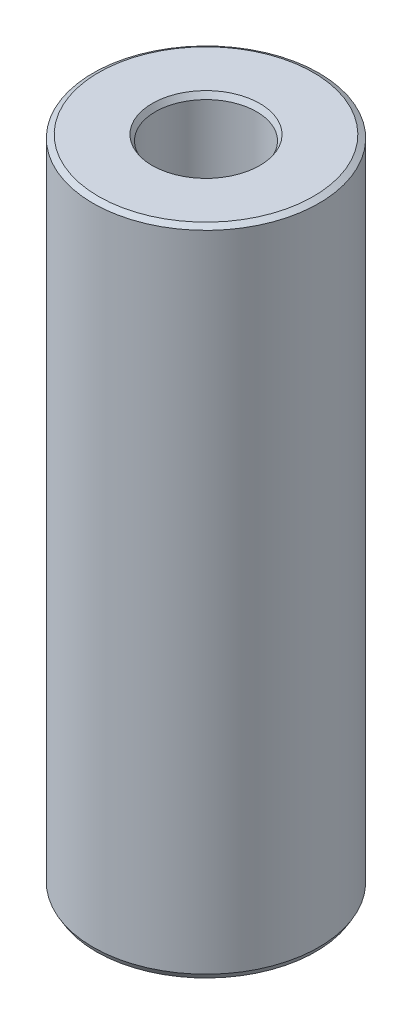
ISO-10303-21;
HEADER;
FILE_DESCRIPTION(('STEP AP214'),'2;1');
FILE_NAME('part.step','',(''),(''),'','','');
FILE_SCHEMA(('AUTOMOTIVE_DESIGN { 1 0 10303 214 1 1 1 1 }'));
ENDSEC;
DATA;
#1=APPLICATION_CONTEXT('core data for automotive mechanical design processes');
#2=APPLICATION_PROTOCOL_DEFINITION('international standard','automotive_design',2000,#1);
#3=PRODUCT_CONTEXT('',#1,'mechanical');
#4=PRODUCT('Part','Part','',(#3));
#5=PRODUCT_RELATED_PRODUCT_CATEGORY('part','',(#4));
#6=PRODUCT_DEFINITION_FORMATION('','',#4);
#7=PRODUCT_DEFINITION_CONTEXT('part definition',#1,'design');
#8=PRODUCT_DEFINITION('design','',#6,#7);
#9=PRODUCT_DEFINITION_SHAPE('','',#8);
#10=(LENGTH_UNIT() NAMED_UNIT(*) SI_UNIT(.MILLI.,.METRE.));
#11=(NAMED_UNIT(*) PLANE_ANGLE_UNIT() SI_UNIT($,.RADIAN.));
#12=(NAMED_UNIT(*) SI_UNIT($,.STERADIAN.) SOLID_ANGLE_UNIT());
#13=UNCERTAINTY_MEASURE_WITH_UNIT(LENGTH_MEASURE(1.E-05),#10,'distance_accuracy_value','');
#14=(GEOMETRIC_REPRESENTATION_CONTEXT(3) GLOBAL_UNCERTAINTY_ASSIGNED_CONTEXT((#13)) GLOBAL_UNIT_ASSIGNED_CONTEXT((#10,
#11,#12)) REPRESENTATION_CONTEXT('',''));
#15=CARTESIAN_POINT('',(0.,0.,0.));
#16=DIRECTION('',(0.,0.,1.));
#17=DIRECTION('',(1.,0.,0.));
#18=AXIS2_PLACEMENT_3D('',#15,#16,#17);
#19=CARTESIAN_POINT('',(0.,231.27756580033,0.));
#20=DIRECTION('',(0.,-1.,0.));
#21=DIRECTION('',(0.,0.,-1.));
#22=AXIS2_PLACEMENT_3D('',#19,#20,#21);
#23=CYLINDRICAL_SURFACE('',#22,40.);
#24=CARTESIAN_POINT('',(0.,1.96135844372239,0.));
#25=DIRECTION('',(0.,1.,0.));
#26=DIRECTION('',(0.,0.,1.));
#27=AXIS2_PLACEMENT_3D('',#24,#25,#26);
#28=CIRCLE('',#27,40.);
#29=CARTESIAN_POINT('',(0.,1.96135844372239,40.));
#30=VERTEX_POINT('',#29);
#31=EDGE_CURVE('E10',#30,#30,#28,.T.);
#32=ORIENTED_EDGE('',*,*,#31,.T.);
#33=EDGE_LOOP('',(#32));
#34=FACE_BOUND('',#33,.T.);
#35=CARTESIAN_POINT('',(0.,230.145174974869,0.));
#36=DIRECTION('',(0.,1.,0.));
#37=DIRECTION('',(0.,0.,1.));
#38=AXIS2_PLACEMENT_3D('',#35,#36,#37);
#39=CIRCLE('',#38,40.);
#40=CARTESIAN_POINT('',(0.,230.145174974869,40.));
#41=VERTEX_POINT('',#40);
#42=EDGE_CURVE('E50',#41,#41,#39,.F.);
#43=ORIENTED_EDGE('',*,*,#42,.T.);
#44=EDGE_LOOP('',(#43));
#45=FACE_BOUND('',#44,.T.);
#46=ADVANCED_FACE('F39',(#34,#45),#23,.T.);
#47=CARTESIAN_POINT('',(0.,231.27756580033,0.));
#48=DIRECTION('',(0.,1.,0.));
#49=DIRECTION('',(0.,0.,1.));
#50=AXIS2_PLACEMENT_3D('',#47,#48,#49);
#51=PLANE('',#50);
#52=CARTESIAN_POINT('',(0.,231.27756580033,0.));
#53=DIRECTION('',(0.,1.,0.));
#54=DIRECTION('',(0.,0.,1.));
#55=AXIS2_PLACEMENT_3D('',#52,#53,#54);
#56=CIRCLE('',#55,19.0580457046);
#57=CARTESIAN_POINT('',(0.,231.27756580033,19.0580457046));
#58=VERTEX_POINT('',#57);
#59=EDGE_CURVE('E58',#58,#58,#56,.F.);
#60=ORIENTED_EDGE('',*,*,#59,.T.);
#61=EDGE_LOOP('',(#60));
#62=FACE_BOUND('',#61,.T.);
#63=CARTESIAN_POINT('',(0.,231.27756580033,0.));
#64=DIRECTION('',(0.,1.,0.));
#65=DIRECTION('',(0.,0.,1.));
#66=AXIS2_PLACEMENT_3D('',#63,#64,#65);
#67=CIRCLE('',#66,38.0386415562776);
#68=CARTESIAN_POINT('',(0.,231.27756580033,38.0386415562776));
#69=VERTEX_POINT('',#68);
#70=EDGE_CURVE('E61',#69,#69,#67,.T.);
#71=ORIENTED_EDGE('',*,*,#70,.T.);
#72=EDGE_LOOP('',(#71));
#73=FACE_BOUND('',#72,.T.);
#74=ADVANCED_FACE('F88',(#62,#73),#51,.T.);
#75=CARTESIAN_POINT('',(0.,0.,0.));
#76=DIRECTION('',(0.,1.,0.));
#77=DIRECTION('',(0.,0.,1.));
#78=AXIS2_PLACEMENT_3D('',#75,#76,#77);
#79=PLANE('',#78);
#80=CARTESIAN_POINT('',(0.,0.,0.));
#81=DIRECTION('',(0.,1.,0.));
#82=DIRECTION('',(0.,0.,1.));
#83=AXIS2_PLACEMENT_3D('',#80,#81,#82);
#84=CIRCLE('',#83,19.887013322862);
#85=CARTESIAN_POINT('',(0.,0.,19.887013322862));
#86=VERTEX_POINT('',#85);
#87=EDGE_CURVE('E51',#86,#86,#84,.T.);
#88=ORIENTED_EDGE('',*,*,#87,.T.);
#89=EDGE_LOOP('',(#88));
#90=FACE_BOUND('',#89,.T.);
#91=CARTESIAN_POINT('',(0.,0.,0.));
#92=DIRECTION('',(0.,1.,0.));
#93=DIRECTION('',(0.,0.,1.));
#94=AXIS2_PLACEMENT_3D('',#91,#92,#93);
#95=CIRCLE('',#94,38.8676091745395);
#96=CARTESIAN_POINT('',(0.,0.,38.8676091745395));
#97=VERTEX_POINT('',#96);
#98=EDGE_CURVE('E54',#97,#97,#95,.F.);
#99=ORIENTED_EDGE('',*,*,#98,.T.);
#100=EDGE_LOOP('',(#99));
#101=FACE_BOUND('',#100,.T.);
#102=ADVANCED_FACE('F83',(#90,#101),#79,.F.);
#103=CARTESIAN_POINT('',(0.,231.27756580033,0.));
#104=DIRECTION('',(0.,-1.,0.));
#105=DIRECTION('',(0.,0.,-1.));
#106=AXIS2_PLACEMENT_3D('',#103,#104,#105);
#107=CYLINDRICAL_SURFACE('',#106,17.9256548791395);
#108=CARTESIAN_POINT('',(0.,229.316207356608,0.));
#109=DIRECTION('',(0.,1.,0.));
#110=DIRECTION('',(0.,0.,1.));
#111=AXIS2_PLACEMENT_3D('',#108,#109,#110);
#112=CIRCLE('',#111,17.9256548791395);
#113=CARTESIAN_POINT('',(0.,229.316207356608,17.9256548791395));
#114=VERTEX_POINT('',#113);
#115=EDGE_CURVE('E67',#114,#114,#112,.T.);
#116=ORIENTED_EDGE('',*,*,#115,.T.);
#117=EDGE_LOOP('',(#116));
#118=FACE_BOUND('',#117,.T.);
#119=CARTESIAN_POINT('',(0.,1.13239082546054,0.));
#120=DIRECTION('',(0.,1.,0.));
#121=DIRECTION('',(0.,0.,1.));
#122=AXIS2_PLACEMENT_3D('',#119,#120,#121);
#123=CIRCLE('',#122,17.9256548791395);
#124=CARTESIAN_POINT('',(0.,1.13239082546054,17.9256548791395));
#125=VERTEX_POINT('',#124);
#126=EDGE_CURVE('E69',#125,#125,#123,.F.);
#127=ORIENTED_EDGE('',*,*,#126,.T.);
#128=EDGE_LOOP('',(#127));
#129=FACE_BOUND('',#128,.T.);
#130=ADVANCED_FACE('F71',(#118,#129),#107,.F.);
#131=CARTESIAN_POINT('',(0.,229.316207356608,0.));
#132=DIRECTION('',(0.,1.,0.));
#133=DIRECTION('',(0.,0.,1.));
#134=AXIS2_PLACEMENT_3D('',#131,#132,#133);
#135=CONICAL_SURFACE('',#134,17.9256548791395,0.523598775598304);
#136=ORIENTED_EDGE('',*,*,#59,.F.);
#137=EDGE_LOOP('',(#136));
#138=FACE_BOUND('',#137,.T.);
#139=ORIENTED_EDGE('',*,*,#115,.F.);
#140=EDGE_LOOP('',(#139));
#141=FACE_BOUND('',#140,.T.);
#142=ADVANCED_FACE('F77',(#138,#141),#135,.F.);
#143=CARTESIAN_POINT('',(0.,0.,0.));
#144=DIRECTION('',(0.,-1.,0.));
#145=DIRECTION('',(0.,0.,-1.));
#146=AXIS2_PLACEMENT_3D('',#143,#144,#145);
#147=CONICAL_SURFACE('',#146,19.887013322862,1.04719755119658);
#148=ORIENTED_EDGE('',*,*,#126,.F.);
#149=EDGE_LOOP('',(#148));
#150=FACE_BOUND('',#149,.T.);
#151=ORIENTED_EDGE('',*,*,#87,.F.);
#152=EDGE_LOOP('',(#151));
#153=FACE_BOUND('',#152,.T.);
#154=ADVANCED_FACE('F73',(#150,#153),#147,.F.);
#155=CARTESIAN_POINT('',(0.,1.96135844372239,0.));
#156=DIRECTION('',(0.,1.,0.));
#157=DIRECTION('',(0.,0.,1.));
#158=AXIS2_PLACEMENT_3D('',#155,#156,#157);
#159=CONICAL_SURFACE('',#158,40.,0.523598775598299);
#160=ORIENTED_EDGE('',*,*,#98,.F.);
#161=EDGE_LOOP('',(#160));
#162=FACE_BOUND('',#161,.T.);
#163=ORIENTED_EDGE('',*,*,#31,.F.);
#164=EDGE_LOOP('',(#163));
#165=FACE_BOUND('',#164,.T.);
#166=ADVANCED_FACE('F76',(#162,#165),#159,.T.);
#167=CARTESIAN_POINT('',(0.,231.27756580033,0.));
#168=DIRECTION('',(0.,-1.,0.));
#169=DIRECTION('',(0.,0.,-1.));
#170=AXIS2_PLACEMENT_3D('',#167,#168,#169);
#171=CONICAL_SURFACE('',#170,38.0386415562776,1.04719755119661);
#172=ORIENTED_EDGE('',*,*,#42,.F.);
#173=EDGE_LOOP('',(#172));
#174=FACE_BOUND('',#173,.T.);
#175=ORIENTED_EDGE('',*,*,#70,.F.);
#176=EDGE_LOOP('',(#175));
#177=FACE_BOUND('',#176,.T.);
#178=ADVANCED_FACE('F45',(#174,#177),#171,.T.);
#179=CLOSED_SHELL('',(#46,#74,#102,#130,#142,#154,#166,#178));
#180=MANIFOLD_SOLID_BREP('B2',#179);
#181=ADVANCED_BREP_SHAPE_REPRESENTATION('',(#18,#180),#14);
#182=SHAPE_DEFINITION_REPRESENTATION(#9,#181);
ENDSEC;
END-ISO-10303-21;
